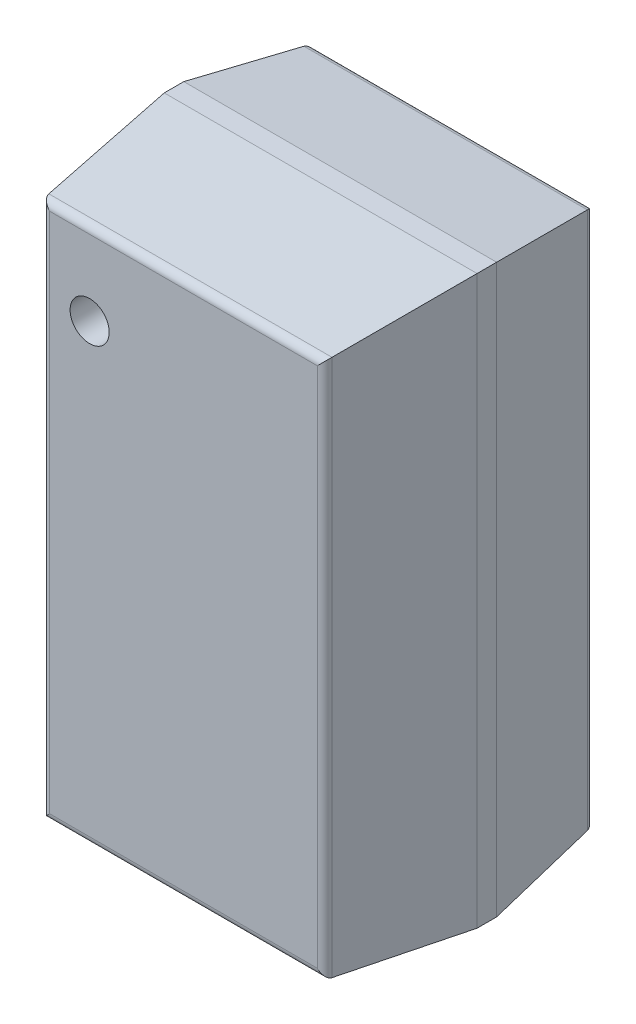
ISO-10303-21;
HEADER;
FILE_DESCRIPTION(('STEP AP214'),'2;1');
FILE_NAME('part.step','',(''),(''),'','','');
FILE_SCHEMA(('AUTOMOTIVE_DESIGN { 1 0 10303 214 1 1 1 1 }'));
ENDSEC;
DATA;
#1=APPLICATION_CONTEXT('core data for automotive mechanical design processes');
#2=APPLICATION_PROTOCOL_DEFINITION('international standard','automotive_design',2000,#1);
#3=PRODUCT_CONTEXT('',#1,'mechanical');
#4=PRODUCT('Part','Part','',(#3));
#5=PRODUCT_RELATED_PRODUCT_CATEGORY('part','',(#4));
#6=PRODUCT_DEFINITION_FORMATION('','',#4);
#7=PRODUCT_DEFINITION_CONTEXT('part definition',#1,'design');
#8=PRODUCT_DEFINITION('design','',#6,#7);
#9=PRODUCT_DEFINITION_SHAPE('','',#8);
#10=(LENGTH_UNIT() NAMED_UNIT(*) SI_UNIT(.MILLI.,.METRE.));
#11=(NAMED_UNIT(*) PLANE_ANGLE_UNIT() SI_UNIT($,.RADIAN.));
#12=(NAMED_UNIT(*) SI_UNIT($,.STERADIAN.) SOLID_ANGLE_UNIT());
#13=UNCERTAINTY_MEASURE_WITH_UNIT(LENGTH_MEASURE(1.E-05),#10,'distance_accuracy_value','');
#14=(GEOMETRIC_REPRESENTATION_CONTEXT(3) GLOBAL_UNCERTAINTY_ASSIGNED_CONTEXT((#13)) GLOBAL_UNIT_ASSIGNED_CONTEXT((#10,
#11,#12)) REPRESENTATION_CONTEXT('',''));
#15=CARTESIAN_POINT('',(0.,0.,0.));
#16=DIRECTION('',(0.,0.,1.));
#17=DIRECTION('',(1.,0.,0.));
#18=AXIS2_PLACEMENT_3D('',#15,#16,#17);
#19=CARTESIAN_POINT('',(-0.48,0.95,1.305));
#20=DIRECTION('',(0.,0.,1.));
#21=DIRECTION('',(1.,0.,0.));
#22=AXIS2_PLACEMENT_3D('',#19,#20,#21);
#23=PLANE('',#22);
#24=CARTESIAN_POINT('',(-0.48,0.95,1.305));
#25=DIRECTION('',(0.,0.,1.));
#26=DIRECTION('',(1.,0.,0.));
#27=AXIS2_PLACEMENT_3D('',#24,#25,#26);
#28=CIRCLE('',#27,0.1);
#29=CARTESIAN_POINT('',(-0.38,0.95,1.305));
#30=VERTEX_POINT('',#29);
#31=EDGE_CURVE('E25',#30,#30,#28,.T.);
#32=ORIENTED_EDGE('',*,*,#31,.T.);
#33=EDGE_LOOP('',(#32));
#34=FACE_BOUND('',#33,.T.);
#35=ADVANCED_FACE('F17',(#34),#23,.T.);
#36=CARTESIAN_POINT('',(-0.48,0.95,1.305));
#37=DIRECTION('',(0.,0.,1.));
#38=DIRECTION('',(1.,0.,0.));
#39=AXIS2_PLACEMENT_3D('',#36,#37,#38);
#40=CYLINDRICAL_SURFACE('',#39,0.1);
#41=ORIENTED_EDGE('',*,*,#31,.F.);
#42=DIRECTION('',(0.,0.,1.));
#43=VECTOR('',#42,1.);
#44=CARTESIAN_POINT('',(-0.38,0.95,1.305));
#45=LINE('',#44,#43);
#46=CARTESIAN_POINT('',(-0.38,0.95,1.45));
#47=VERTEX_POINT('',#46);
#48=EDGE_CURVE('E11',#30,#47,#45,.T.);
#49=ORIENTED_EDGE('',*,*,#48,.T.);
#50=CARTESIAN_POINT('',(-0.48,0.95,1.45));
#51=DIRECTION('',(0.,0.,1.));
#52=DIRECTION('',(1.,0.,0.));
#53=AXIS2_PLACEMENT_3D('',#50,#51,#52);
#54=CIRCLE('',#53,0.1);
#55=EDGE_CURVE('E193',#47,#47,#54,.T.);
#56=ORIENTED_EDGE('',*,*,#55,.T.);
#57=ORIENTED_EDGE('',*,*,#48,.F.);
#58=EDGE_LOOP('',(#41,#49,#56,#57));
#59=FACE_BOUND('',#58,.T.);
#60=ADVANCED_FACE('F260',(#59),#40,.F.);
#61=CARTESIAN_POINT('',(0.68430217805,-1.37,1.41));
#62=DIRECTION('',(0.,1.,0.));
#63=DIRECTION('',(0.,0.,1.));
#64=AXIS2_PLACEMENT_3D('',#61,#62,#63);
#65=CYLINDRICAL_SURFACE('',#64,0.04);
#66=CARTESIAN_POINT('',(0.68430217805,-1.33430217805,1.41));
#67=DIRECTION('',(-0.707106781186548,-0.707106781186548,0.));
#68=DIRECTION('',(0.707106781186548,-0.707106781186548,0.));
#69=AXIS2_PLACEMENT_3D('',#66,#67,#68);
#70=ELLIPSE('',#69,0.05656854249492,0.04);
#71=CARTESIAN_POINT('',(0.724044605579,-1.374044605579,1.414532047456));
#72=VERTEX_POINT('',#71);
#73=CARTESIAN_POINT('',(0.68430217805,-1.33430217805,1.45));
#74=VERTEX_POINT('',#73);
#75=EDGE_CURVE('E243',#72,#74,#70,.T.);
#76=ORIENTED_EDGE('',*,*,#75,.F.);
#77=DIRECTION('',(0.,1.,0.));
#78=VECTOR('',#77,1.);
#79=CARTESIAN_POINT('',(0.724044605579,-1.37,1.414532047456));
#80=LINE('',#79,#78);
#81=CARTESIAN_POINT('',(0.724044605579,1.374044605579,1.414532047456));
#82=VERTEX_POINT('',#81);
#83=EDGE_CURVE('E147',#72,#82,#80,.T.);
#84=ORIENTED_EDGE('',*,*,#83,.T.);
#85=CARTESIAN_POINT('',(0.68430217805,1.33430217805,1.41));
#86=DIRECTION('',(-0.707106781186548,0.707106781186548,0.));
#87=DIRECTION('',(0.707106781186548,0.707106781186548,0.));
#88=AXIS2_PLACEMENT_3D('',#85,#86,#87);
#89=ELLIPSE('',#88,0.05656854249492,0.04);
#90=CARTESIAN_POINT('',(0.68430217805,1.33430217805,1.45));
#91=VERTEX_POINT('',#90);
#92=EDGE_CURVE('E195',#91,#82,#89,.T.);
#93=ORIENTED_EDGE('',*,*,#92,.F.);
#94=DIRECTION('',(0.,1.,0.));
#95=VECTOR('',#94,1.);
#96=CARTESIAN_POINT('',(0.68430217805,-1.37,1.45));
#97=LINE('',#96,#95);
#98=EDGE_CURVE('E251',#74,#91,#97,.T.);
#99=ORIENTED_EDGE('',*,*,#98,.F.);
#100=EDGE_LOOP('',(#76,#84,#93,#99));
#101=FACE_BOUND('',#100,.T.);
#102=ADVANCED_FACE('F262',(#101),#65,.T.);
#103=CARTESIAN_POINT('',(-0.72,1.33430217805,1.41));
#104=DIRECTION('',(1.,0.,0.));
#105=DIRECTION('',(0.,0.,1.));
#106=AXIS2_PLACEMENT_3D('',#103,#104,#105);
#107=CYLINDRICAL_SURFACE('',#106,0.04);
#108=DIRECTION('',(1.,0.,0.));
#109=VECTOR('',#108,1.);
#110=CARTESIAN_POINT('',(-0.72,1.33430217805,1.45));
#111=LINE('',#110,#109);
#112=CARTESIAN_POINT('',(-0.68430217805,1.33430217805,1.45));
#113=VERTEX_POINT('',#112);
#114=EDGE_CURVE('E196',#113,#91,#111,.T.);
#115=ORIENTED_EDGE('',*,*,#114,.T.);
#116=ORIENTED_EDGE('',*,*,#92,.T.);
#117=DIRECTION('',(1.,0.,0.));
#118=VECTOR('',#117,1.);
#119=CARTESIAN_POINT('',(-0.72,1.374044605579,1.414532047456));
#120=LINE('',#119,#118);
#121=CARTESIAN_POINT('',(-0.724044605579,1.374044605579,1.414532047456));
#122=VERTEX_POINT('',#121);
#123=EDGE_CURVE('E239',#122,#82,#120,.T.);
#124=ORIENTED_EDGE('',*,*,#123,.F.);
#125=CARTESIAN_POINT('',(-0.68430217805,1.33430217805,1.41));
#126=DIRECTION('',(0.707106781186548,0.707106781186548,0.));
#127=DIRECTION('',(-0.707106781186548,0.707106781186548,0.));
#128=AXIS2_PLACEMENT_3D('',#125,#126,#127);
#129=ELLIPSE('',#128,0.05656854249492,0.04);
#130=EDGE_CURVE('E235',#122,#113,#129,.T.);
#131=ORIENTED_EDGE('',*,*,#130,.T.);
#132=EDGE_LOOP('',(#115,#116,#124,#131));
#133=FACE_BOUND('',#132,.T.);
#134=ADVANCED_FACE('F268',(#133),#107,.T.);
#135=CARTESIAN_POINT('',(-0.8,-1.45,1.45));
#136=DIRECTION('',(0.,0.,1.));
#137=DIRECTION('',(1.,0.,0.));
#138=AXIS2_PLACEMENT_3D('',#135,#136,#137);
#139=PLANE('',#138);
#140=ORIENTED_EDGE('',*,*,#55,.F.);
#141=EDGE_LOOP('',(#140));
#142=FACE_BOUND('',#141,.T.);
#143=DIRECTION('',(0.,1.,0.));
#144=VECTOR('',#143,1.);
#145=CARTESIAN_POINT('',(-0.68430217805,-1.37,1.45));
#146=LINE('',#145,#144);
#147=CARTESIAN_POINT('',(-0.68430217805,-1.33430217805,1.45));
#148=VERTEX_POINT('',#147);
#149=EDGE_CURVE('E231',#148,#113,#146,.T.);
#150=ORIENTED_EDGE('',*,*,#149,.F.);
#151=DIRECTION('',(1.,0.,0.));
#152=VECTOR('',#151,1.);
#153=CARTESIAN_POINT('',(-0.72,-1.33430217805,1.45));
#154=LINE('',#153,#152);
#155=EDGE_CURVE('E247',#148,#74,#154,.T.);
#156=ORIENTED_EDGE('',*,*,#155,.T.);
#157=ORIENTED_EDGE('',*,*,#98,.T.);
#158=ORIENTED_EDGE('',*,*,#114,.F.);
#159=EDGE_LOOP('',(#150,#156,#157,#158));
#160=FACE_BOUND('',#159,.T.);
#161=ADVANCED_FACE('F274',(#142,#160),#139,.T.);
#162=CARTESIAN_POINT('',(-0.72,-1.33430217805,1.41));
#163=DIRECTION('',(1.,0.,0.));
#164=DIRECTION('',(0.,-0.993560688212825,0.11330118639298));
#165=AXIS2_PLACEMENT_3D('',#162,#163,#164);
#166=CYLINDRICAL_SURFACE('',#165,0.04);
#167=DIRECTION('',(1.,0.,0.));
#168=VECTOR('',#167,1.);
#169=CARTESIAN_POINT('',(-0.72,-1.374044605579,1.414532047456));
#170=LINE('',#169,#168);
#171=CARTESIAN_POINT('',(-0.724044605579,-1.374044605579,1.414532047456));
#172=VERTEX_POINT('',#171);
#173=EDGE_CURVE('E153',#172,#72,#170,.T.);
#174=ORIENTED_EDGE('',*,*,#173,.T.);
#175=ORIENTED_EDGE('',*,*,#75,.T.);
#176=ORIENTED_EDGE('',*,*,#155,.F.);
#177=CARTESIAN_POINT('',(-0.68430217805,-1.33430217805,1.41));
#178=DIRECTION('',(-0.707106781186548,0.707106781186548,0.));
#179=DIRECTION('',(0.707106781186548,0.707106781186548,0.));
#180=AXIS2_PLACEMENT_3D('',#177,#178,#179);
#181=ELLIPSE('',#180,0.05656854249492,0.04);
#182=EDGE_CURVE('E227',#172,#148,#181,.T.);
#183=ORIENTED_EDGE('',*,*,#182,.F.);
#184=EDGE_LOOP('',(#174,#175,#176,#183));
#185=FACE_BOUND('',#184,.T.);
#186=ADVANCED_FACE('F278',(#185),#166,.T.);
#187=CARTESIAN_POINT('',(0.76,-1.45,1.099232026655));
#188=DIRECTION('',(0.993560688212825,0.,0.11330118639298));
#189=DIRECTION('',(0.,-1.,0.));
#190=AXIS2_PLACEMENT_3D('',#187,#188,#189);
#191=PLANE('',#190);
#192=DIRECTION('',(-0.112580881361013,0.112580881361013,0.987244189805114));
#193=VECTOR('',#192,1.);
#194=CARTESIAN_POINT('',(0.750367414316,-1.400367414316,1.18370209062));
#195=LINE('',#194,#193);
#196=CARTESIAN_POINT('',(0.8,-1.45,0.74846405331));
#197=VERTEX_POINT('',#196);
#198=EDGE_CURVE('E140',#197,#72,#195,.T.);
#199=ORIENTED_EDGE('',*,*,#198,.F.);
#200=DIRECTION('',(0.,1.,0.));
#201=VECTOR('',#200,1.);
#202=CARTESIAN_POINT('',(0.8,-1.45,0.74846405331));
#203=LINE('',#202,#201);
#204=CARTESIAN_POINT('',(0.8,1.45,0.74846405331));
#205=VERTEX_POINT('',#204);
#206=EDGE_CURVE('E144',#197,#205,#203,.T.);
#207=ORIENTED_EDGE('',*,*,#206,.T.);
#208=DIRECTION('',(-0.112580881361013,-0.112580881361013,0.987244189805114));
#209=VECTOR('',#208,1.);
#210=CARTESIAN_POINT('',(0.731989454786,1.381989454786,1.344862081079));
#211=LINE('',#210,#209);
#212=EDGE_CURVE('E240',#205,#82,#211,.T.);
#213=ORIENTED_EDGE('',*,*,#212,.T.);
#214=ORIENTED_EDGE('',*,*,#83,.F.);
#215=EDGE_LOOP('',(#199,#207,#213,#214));
#216=FACE_BOUND('',#215,.T.);
#217=ADVANCED_FACE('F142',(#216),#191,.T.);
#218=CARTESIAN_POINT('',(-0.8,1.41,1.099232026655));
#219=DIRECTION('',(0.,0.993560688212825,0.11330118639298));
#220=DIRECTION('',(1.,0.,0.));
#221=AXIS2_PLACEMENT_3D('',#218,#219,#220);
#222=PLANE('',#221);
#223=ORIENTED_EDGE('',*,*,#123,.T.);
#224=ORIENTED_EDGE('',*,*,#212,.F.);
#225=DIRECTION('',(1.,0.,0.));
#226=VECTOR('',#225,1.);
#227=CARTESIAN_POINT('',(-0.8,1.45,0.74846405331));
#228=LINE('',#227,#226);
#229=CARTESIAN_POINT('',(-0.8,1.45,0.74846405331));
#230=VERTEX_POINT('',#229);
#231=EDGE_CURVE('E165',#230,#205,#228,.T.);
#232=ORIENTED_EDGE('',*,*,#231,.F.);
#233=DIRECTION('',(0.112580881361013,-0.112580881361013,0.987244189805114));
#234=VECTOR('',#233,1.);
#235=CARTESIAN_POINT('',(-0.742129018664,1.392129018664,1.255946224274));
#236=LINE('',#235,#234);
#237=EDGE_CURVE('E219',#230,#122,#236,.T.);
#238=ORIENTED_EDGE('',*,*,#237,.T.);
#239=EDGE_LOOP('',(#223,#224,#232,#238));
#240=FACE_BOUND('',#239,.T.);
#241=ADVANCED_FACE('F285',(#240),#222,.T.);
#242=CARTESIAN_POINT('',(-0.68430217805,-1.37,1.41));
#243=DIRECTION('',(0.,1.,0.));
#244=DIRECTION('',(-0.993560688212825,0.,0.11330118639298));
#245=AXIS2_PLACEMENT_3D('',#242,#243,#244);
#246=CYLINDRICAL_SURFACE('',#245,0.04);
#247=ORIENTED_EDGE('',*,*,#182,.T.);
#248=ORIENTED_EDGE('',*,*,#149,.T.);
#249=ORIENTED_EDGE('',*,*,#130,.F.);
#250=DIRECTION('',(0.,1.,0.));
#251=VECTOR('',#250,1.);
#252=CARTESIAN_POINT('',(-0.724044605579,-1.37,1.414532047456));
#253=LINE('',#252,#251);
#254=EDGE_CURVE('E215',#172,#122,#253,.T.);
#255=ORIENTED_EDGE('',*,*,#254,.F.);
#256=EDGE_LOOP('',(#247,#248,#249,#255));
#257=FACE_BOUND('',#256,.T.);
#258=ADVANCED_FACE('F288',(#257),#246,.T.);
#259=CARTESIAN_POINT('',(-0.8,-1.41,1.099232026655));
#260=DIRECTION('',(0.,0.993560688212825,-0.11330118639298));
#261=DIRECTION('',(-1.,0.,0.));
#262=AXIS2_PLACEMENT_3D('',#259,#260,#261);
#263=PLANE('',#262);
#264=DIRECTION('',(0.112580881361013,0.112580881361013,0.987244189805114));
#265=VECTOR('',#264,1.);
#266=CARTESIAN_POINT('',(-0.760506978194,-1.410506978194,1.094786233815));
#267=LINE('',#266,#265);
#268=CARTESIAN_POINT('',(-0.8,-1.45,0.74846405331));
#269=VERTEX_POINT('',#268);
#270=EDGE_CURVE('E180',#269,#172,#267,.T.);
#271=ORIENTED_EDGE('',*,*,#270,.F.);
#272=DIRECTION('',(1.,0.,0.));
#273=VECTOR('',#272,1.);
#274=CARTESIAN_POINT('',(-0.8,-1.45,0.74846405331));
#275=LINE('',#274,#273);
#276=EDGE_CURVE('E170',#269,#197,#275,.T.);
#277=ORIENTED_EDGE('',*,*,#276,.T.);
#278=ORIENTED_EDGE('',*,*,#198,.T.);
#279=ORIENTED_EDGE('',*,*,#173,.F.);
#280=EDGE_LOOP('',(#271,#277,#278,#279));
#281=FACE_BOUND('',#280,.T.);
#282=ADVANCED_FACE('F178',(#281),#263,.F.);
#283=CARTESIAN_POINT('',(0.8,-1.45,0.075));
#284=DIRECTION('',(1.,0.,0.));
#285=DIRECTION('',(0.,1.,0.));
#286=AXIS2_PLACEMENT_3D('',#283,#284,#285);
#287=PLANE('',#286);
#288=DIRECTION('',(0.,0.,1.));
#289=VECTOR('',#288,1.);
#290=CARTESIAN_POINT('',(0.8,-1.45,0.075));
#291=LINE('',#290,#289);
#292=CARTESIAN_POINT('',(0.8,-1.45,0.64846405331));
#293=VERTEX_POINT('',#292);
#294=EDGE_CURVE('E161',#293,#197,#291,.T.);
#295=ORIENTED_EDGE('',*,*,#294,.F.);
#296=DIRECTION('',(0.,1.,0.));
#297=VECTOR('',#296,1.);
#298=CARTESIAN_POINT('',(0.8,-1.45,0.64846405331));
#299=LINE('',#298,#297);
#300=CARTESIAN_POINT('',(0.8,1.45,0.64846405331));
#301=VERTEX_POINT('',#300);
#302=EDGE_CURVE('E203',#293,#301,#299,.T.);
#303=ORIENTED_EDGE('',*,*,#302,.T.);
#304=DIRECTION('',(0.,0.,1.));
#305=VECTOR('',#304,1.);
#306=CARTESIAN_POINT('',(0.8,1.45,0.075));
#307=LINE('',#306,#305);
#308=EDGE_CURVE('E163',#301,#205,#307,.T.);
#309=ORIENTED_EDGE('',*,*,#308,.T.);
#310=ORIENTED_EDGE('',*,*,#206,.F.);
#311=EDGE_LOOP('',(#295,#303,#309,#310));
#312=FACE_BOUND('',#311,.T.);
#313=ADVANCED_FACE('F159',(#312),#287,.T.);
#314=CARTESIAN_POINT('',(0.685192776379,-1.37,0.115));
#315=DIRECTION('',(0.,1.,0.));
#316=DIRECTION('',(0.,0.,-1.));
#317=AXIS2_PLACEMENT_3D('',#314,#315,#316);
#318=CYLINDRICAL_SURFACE('',#317,0.04);
#319=DIRECTION('',(0.,1.,0.));
#320=VECTOR('',#319,1.);
#321=CARTESIAN_POINT('',(0.685192776379,-1.37,0.075));
#322=LINE('',#321,#320);
#323=CARTESIAN_POINT('',(0.685192776379,-1.335192776379,0.075));
#324=VERTEX_POINT('',#323);
#325=CARTESIAN_POINT('',(0.685192776379,1.335192776379,0.075));
#326=VERTEX_POINT('',#325);
#327=EDGE_CURVE('E208',#324,#326,#322,.T.);
#328=ORIENTED_EDGE('',*,*,#327,.T.);
#329=CARTESIAN_POINT('',(0.685192776379,1.335192776379,0.115));
#330=DIRECTION('',(0.707106781186548,-0.707106781186548,0.));
#331=DIRECTION('',(0.707106781186548,0.707106781186548,0.));
#332=AXIS2_PLACEMENT_3D('',#329,#330,#331);
#333=ELLIPSE('',#332,0.05656854249492,0.04);
#334=CARTESIAN_POINT('',(0.72480914464,1.37480914464,0.109473394727));
#335=VERTEX_POINT('',#334);
#336=EDGE_CURVE('E212',#326,#335,#333,.T.);
#337=ORIENTED_EDGE('',*,*,#336,.T.);
#338=DIRECTION('',(0.,1.,0.));
#339=VECTOR('',#338,1.);
#340=CARTESIAN_POINT('',(0.72480914464,-1.37,0.109473394727));
#341=LINE('',#340,#339);
#342=CARTESIAN_POINT('',(0.72480914464,-1.37480914464,0.109473394727));
#343=VERTEX_POINT('',#342);
#344=EDGE_CURVE('E176',#343,#335,#341,.T.);
#345=ORIENTED_EDGE('',*,*,#344,.F.);
#346=CARTESIAN_POINT('',(0.685192776379,-1.335192776379,0.115));
#347=DIRECTION('',(0.707106781186548,0.707106781186548,0.));
#348=DIRECTION('',(0.707106781186548,-0.707106781186548,0.));
#349=AXIS2_PLACEMENT_3D('',#346,#347,#348);
#350=ELLIPSE('',#349,0.05656854249492,0.04);
#351=EDGE_CURVE('E182',#343,#324,#350,.T.);
#352=ORIENTED_EDGE('',*,*,#351,.T.);
#353=EDGE_LOOP('',(#328,#337,#345,#352));
#354=FACE_BOUND('',#353,.T.);
#355=ADVANCED_FACE('F294',(#354),#318,.T.);
#356=CARTESIAN_POINT('',(-0.8,1.45,0.075));
#357=DIRECTION('',(0.,1.,0.));
#358=DIRECTION('',(1.,0.,0.));
#359=AXIS2_PLACEMENT_3D('',#356,#357,#358);
#360=PLANE('',#359);
#361=ORIENTED_EDGE('',*,*,#308,.F.);
#362=DIRECTION('',(1.,0.,0.));
#363=VECTOR('',#362,1.);
#364=CARTESIAN_POINT('',(-0.8,1.45,0.64846405331));
#365=LINE('',#364,#363);
#366=CARTESIAN_POINT('',(-0.8,1.45,0.64846405331));
#367=VERTEX_POINT('',#366);
#368=EDGE_CURVE('E406',#367,#301,#365,.T.);
#369=ORIENTED_EDGE('',*,*,#368,.F.);
#370=DIRECTION('',(0.,0.,1.));
#371=VECTOR('',#370,1.);
#372=CARTESIAN_POINT('',(-0.8,1.45,0.075));
#373=LINE('',#372,#371);
#374=EDGE_CURVE('E407',#367,#230,#373,.T.);
#375=ORIENTED_EDGE('',*,*,#374,.T.);
#376=ORIENTED_EDGE('',*,*,#231,.T.);
#377=EDGE_LOOP('',(#361,#369,#375,#376));
#378=FACE_BOUND('',#377,.T.);
#379=ADVANCED_FACE('F299',(#378),#360,.T.);
#380=CARTESIAN_POINT('',(-0.76,-1.45,1.099232026655));
#381=DIRECTION('',(0.993560688212825,0.,-0.11330118639298));
#382=DIRECTION('',(0.,-1.,0.));
#383=AXIS2_PLACEMENT_3D('',#380,#381,#382);
#384=PLANE('',#383);
#385=ORIENTED_EDGE('',*,*,#254,.T.);
#386=ORIENTED_EDGE('',*,*,#237,.F.);
#387=DIRECTION('',(0.,1.,0.));
#388=VECTOR('',#387,1.);
#389=CARTESIAN_POINT('',(-0.8,-1.45,0.74846405331));
#390=LINE('',#389,#388);
#391=EDGE_CURVE('E402',#269,#230,#390,.T.);
#392=ORIENTED_EDGE('',*,*,#391,.F.);
#393=ORIENTED_EDGE('',*,*,#270,.T.);
#394=EDGE_LOOP('',(#385,#386,#392,#393));
#395=FACE_BOUND('',#394,.T.);
#396=ADVANCED_FACE('F295',(#395),#384,.F.);
#397=CARTESIAN_POINT('',(-0.72,1.335192776379,0.115));
#398=DIRECTION('',(1.,0.,0.));
#399=DIRECTION('',(0.,0.,-1.));
#400=AXIS2_PLACEMENT_3D('',#397,#398,#399);
#401=CYLINDRICAL_SURFACE('',#400,0.04);
#402=CARTESIAN_POINT('',(-0.685192776379,1.335192776379,0.115));
#403=DIRECTION('',(-0.707106781186548,-0.707106781186548,0.));
#404=DIRECTION('',(-0.707106781186548,0.707106781186548,0.));
#405=AXIS2_PLACEMENT_3D('',#402,#403,#404);
#406=ELLIPSE('',#405,0.05656854249492,0.04);
#407=CARTESIAN_POINT('',(-0.72480914464,1.37480914464,0.109473394727));
#408=VERTEX_POINT('',#407);
#409=CARTESIAN_POINT('',(-0.685192776379,1.335192776379,0.075));
#410=VERTEX_POINT('',#409);
#411=EDGE_CURVE('E373',#408,#410,#406,.T.);
#412=ORIENTED_EDGE('',*,*,#411,.F.);
#413=DIRECTION('',(1.,0.,0.));
#414=VECTOR('',#413,1.);
#415=CARTESIAN_POINT('',(-0.72,1.37480914464,0.109473394727));
#416=LINE('',#415,#414);
#417=EDGE_CURVE('E394',#408,#335,#416,.T.);
#418=ORIENTED_EDGE('',*,*,#417,.T.);
#419=ORIENTED_EDGE('',*,*,#336,.F.);
#420=DIRECTION('',(1.,0.,0.));
#421=VECTOR('',#420,1.);
#422=CARTESIAN_POINT('',(-0.72,1.335192776379,0.075));
#423=LINE('',#422,#421);
#424=EDGE_CURVE('E204',#410,#326,#423,.T.);
#425=ORIENTED_EDGE('',*,*,#424,.F.);
#426=EDGE_LOOP('',(#412,#418,#419,#425));
#427=FACE_BOUND('',#426,.T.);
#428=ADVANCED_FACE('F298',(#427),#401,.T.);
#429=CARTESIAN_POINT('',(-0.8,-1.45,0.075));
#430=DIRECTION('',(0.,0.,1.));
#431=DIRECTION('',(1.,0.,0.));
#432=AXIS2_PLACEMENT_3D('',#429,#430,#431);
#433=PLANE('',#432);
#434=ORIENTED_EDGE('',*,*,#424,.T.);
#435=ORIENTED_EDGE('',*,*,#327,.F.);
#436=DIRECTION('',(1.,0.,0.));
#437=VECTOR('',#436,1.);
#438=CARTESIAN_POINT('',(-0.72,-1.335192776379,0.075));
#439=LINE('',#438,#437);
#440=CARTESIAN_POINT('',(-0.685192776379,-1.335192776379,0.075));
#441=VERTEX_POINT('',#440);
#442=EDGE_CURVE('E189',#441,#324,#439,.T.);
#443=ORIENTED_EDGE('',*,*,#442,.F.);
#444=DIRECTION('',(0.,1.,0.));
#445=VECTOR('',#444,1.);
#446=CARTESIAN_POINT('',(-0.685192776379,-1.37,0.075));
#447=LINE('',#446,#445);
#448=EDGE_CURVE('E377',#441,#410,#447,.T.);
#449=ORIENTED_EDGE('',*,*,#448,.T.);
#450=EDGE_LOOP('',(#434,#435,#443,#449));
#451=FACE_BOUND('',#450,.T.);
#452=ADVANCED_FACE('F301',(#451),#433,.F.);
#453=CARTESIAN_POINT('',(0.76,-1.45,0.361732026655));
#454=DIRECTION('',(-0.990409206514318,0.,0.138165131823044));
#455=DIRECTION('',(0.,1.,0.));
#456=AXIS2_PLACEMENT_3D('',#453,#454,#455);
#457=PLANE('',#456);
#458=ORIENTED_EDGE('',*,*,#344,.T.);
#459=DIRECTION('',(-0.136864958531939,-0.136864958531939,-0.981089173445565));
#460=VECTOR('',#459,1.);
#461=CARTESIAN_POINT('',(0.718602242709,1.368602242709,0.06498045547816));
#462=LINE('',#461,#460);
#463=EDGE_CURVE('E398',#301,#335,#462,.T.);
#464=ORIENTED_EDGE('',*,*,#463,.F.);
#465=ORIENTED_EDGE('',*,*,#302,.F.);
#466=DIRECTION('',(-0.136864958531939,0.136864958531939,-0.981089173445565));
#467=VECTOR('',#466,1.);
#468=CARTESIAN_POINT('',(0.745763667176,-1.395763667176,0.259681712585));
#469=LINE('',#468,#467);
#470=EDGE_CURVE('E369',#293,#343,#469,.T.);
#471=ORIENTED_EDGE('',*,*,#470,.T.);
#472=EDGE_LOOP('',(#458,#464,#465,#471));
#473=FACE_BOUND('',#472,.T.);
#474=ADVANCED_FACE('F304',(#473),#457,.F.);
#475=CARTESIAN_POINT('',(-0.8,-1.45,0.075));
#476=DIRECTION('',(0.,1.,0.));
#477=DIRECTION('',(1.,0.,0.));
#478=AXIS2_PLACEMENT_3D('',#475,#476,#477);
#479=PLANE('',#478);
#480=ORIENTED_EDGE('',*,*,#276,.F.);
#481=DIRECTION('',(0.,0.,1.));
#482=VECTOR('',#481,1.);
#483=CARTESIAN_POINT('',(-0.8,-1.45,0.075));
#484=LINE('',#483,#482);
#485=CARTESIAN_POINT('',(-0.8,-1.45,0.64846405331));
#486=VERTEX_POINT('',#485);
#487=EDGE_CURVE('E403',#486,#269,#484,.T.);
#488=ORIENTED_EDGE('',*,*,#487,.F.);
#489=DIRECTION('',(1.,0.,0.));
#490=VECTOR('',#489,1.);
#491=CARTESIAN_POINT('',(-0.8,-1.45,0.64846405331));
#492=LINE('',#491,#490);
#493=EDGE_CURVE('E173',#486,#293,#492,.T.);
#494=ORIENTED_EDGE('',*,*,#493,.T.);
#495=ORIENTED_EDGE('',*,*,#294,.T.);
#496=EDGE_LOOP('',(#480,#488,#494,#495));
#497=FACE_BOUND('',#496,.T.);
#498=ADVANCED_FACE('F169',(#497),#479,.F.);
#499=CARTESIAN_POINT('',(-0.72,-1.335192776379,0.115));
#500=DIRECTION('',(1.,0.,0.));
#501=DIRECTION('',(0.,-0.990409206514318,-0.138165131823044));
#502=AXIS2_PLACEMENT_3D('',#499,#500,#501);
#503=CYLINDRICAL_SURFACE('',#502,0.04);
#504=CARTESIAN_POINT('',(-0.685192776379,-1.335192776379,0.115));
#505=DIRECTION('',(0.707106781186548,-0.707106781186548,0.));
#506=DIRECTION('',(0.707106781186548,0.707106781186548,0.));
#507=AXIS2_PLACEMENT_3D('',#504,#505,#506);
#508=ELLIPSE('',#507,0.05656854249492,0.04);
#509=CARTESIAN_POINT('',(-0.72480914464,-1.37480914464,0.109473394727));
#510=VERTEX_POINT('',#509);
#511=EDGE_CURVE('E391',#510,#441,#508,.T.);
#512=ORIENTED_EDGE('',*,*,#511,.T.);
#513=ORIENTED_EDGE('',*,*,#442,.T.);
#514=ORIENTED_EDGE('',*,*,#351,.F.);
#515=DIRECTION('',(1.,0.,0.));
#516=VECTOR('',#515,1.);
#517=CARTESIAN_POINT('',(-0.72,-1.37480914464,0.109473394727));
#518=LINE('',#517,#516);
#519=EDGE_CURVE('E367',#510,#343,#518,.T.);
#520=ORIENTED_EDGE('',*,*,#519,.F.);
#521=EDGE_LOOP('',(#512,#513,#514,#520));
#522=FACE_BOUND('',#521,.T.);
#523=ADVANCED_FACE('F311',(#522),#503,.T.);
#524=CARTESIAN_POINT('',(-0.8,1.41,0.361732026655));
#525=DIRECTION('',(0.,-0.990409206514318,0.138165131823044));
#526=DIRECTION('',(-1.,0.,0.));
#527=AXIS2_PLACEMENT_3D('',#524,#525,#526);
#528=PLANE('',#527);
#529=DIRECTION('',(0.136864958531939,-0.136864958531939,-0.981089173445565));
#530=VECTOR('',#529,1.);
#531=CARTESIAN_POINT('',(-0.733587856208,1.383587856208,0.17240183871));
#532=LINE('',#531,#530);
#533=EDGE_CURVE('E364',#367,#408,#532,.T.);
#534=ORIENTED_EDGE('',*,*,#533,.F.);
#535=ORIENTED_EDGE('',*,*,#368,.T.);
#536=ORIENTED_EDGE('',*,*,#463,.T.);
#537=ORIENTED_EDGE('',*,*,#417,.F.);
#538=EDGE_LOOP('',(#534,#535,#536,#537));
#539=FACE_BOUND('',#538,.T.);
#540=ADVANCED_FACE('F320',(#539),#528,.F.);
#541=CARTESIAN_POINT('',(-0.8,-1.45,0.075));
#542=DIRECTION('',(1.,0.,0.));
#543=DIRECTION('',(0.,1.,0.));
#544=AXIS2_PLACEMENT_3D('',#541,#542,#543);
#545=PLANE('',#544);
#546=ORIENTED_EDGE('',*,*,#391,.T.);
#547=ORIENTED_EDGE('',*,*,#374,.F.);
#548=DIRECTION('',(0.,1.,0.));
#549=VECTOR('',#548,1.);
#550=CARTESIAN_POINT('',(-0.8,-1.45,0.64846405331));
#551=LINE('',#550,#549);
#552=EDGE_CURVE('E355',#486,#367,#551,.T.);
#553=ORIENTED_EDGE('',*,*,#552,.F.);
#554=ORIENTED_EDGE('',*,*,#487,.T.);
#555=EDGE_LOOP('',(#546,#547,#553,#554));
#556=FACE_BOUND('',#555,.T.);
#557=ADVANCED_FACE('F325',(#556),#545,.F.);
#558=CARTESIAN_POINT('',(-0.685192776379,-1.37,0.115));
#559=DIRECTION('',(0.,1.,0.));
#560=DIRECTION('',(-0.990409206514318,0.,-0.138165131823044));
#561=AXIS2_PLACEMENT_3D('',#558,#559,#560);
#562=CYLINDRICAL_SURFACE('',#561,0.04);
#563=DIRECTION('',(0.,1.,0.));
#564=VECTOR('',#563,1.);
#565=CARTESIAN_POINT('',(-0.72480914464,-1.37,0.109473394727));
#566=LINE('',#565,#564);
#567=EDGE_CURVE('E357',#510,#408,#566,.T.);
#568=ORIENTED_EDGE('',*,*,#567,.T.);
#569=ORIENTED_EDGE('',*,*,#411,.T.);
#570=ORIENTED_EDGE('',*,*,#448,.F.);
#571=ORIENTED_EDGE('',*,*,#511,.F.);
#572=EDGE_LOOP('',(#568,#569,#570,#571));
#573=FACE_BOUND('',#572,.T.);
#574=ADVANCED_FACE('F328',(#573),#562,.T.);
#575=CARTESIAN_POINT('',(-0.8,-1.41,0.361732026655));
#576=DIRECTION('',(0.,-0.990409206514318,-0.138165131823044));
#577=DIRECTION('',(0.,0.138165131823044,-0.990409206514318));
#578=AXIS2_PLACEMENT_3D('',#575,#576,#577);
#579=PLANE('',#578);
#580=ORIENTED_EDGE('',*,*,#519,.T.);
#581=ORIENTED_EDGE('',*,*,#470,.F.);
#582=ORIENTED_EDGE('',*,*,#493,.F.);
#583=DIRECTION('',(0.136864958531939,0.136864958531939,-0.981089173445565));
#584=VECTOR('',#583,1.);
#585=CARTESIAN_POINT('',(-0.760749280675,-1.410749280675,0.367103095817));
#586=LINE('',#585,#584);
#587=EDGE_CURVE('E352',#486,#510,#586,.T.);
#588=ORIENTED_EDGE('',*,*,#587,.T.);
#589=EDGE_LOOP('',(#580,#581,#582,#588));
#590=FACE_BOUND('',#589,.T.);
#591=ADVANCED_FACE('F332',(#590),#579,.T.);
#592=CARTESIAN_POINT('',(-0.76,-1.45,0.361732026655));
#593=DIRECTION('',(-0.990409206514318,0.,-0.138165131823044));
#594=DIRECTION('',(-0.138165131823044,0.,0.990409206514318));
#595=AXIS2_PLACEMENT_3D('',#592,#593,#594);
#596=PLANE('',#595);
#597=ORIENTED_EDGE('',*,*,#587,.F.);
#598=ORIENTED_EDGE('',*,*,#552,.T.);
#599=ORIENTED_EDGE('',*,*,#533,.T.);
#600=ORIENTED_EDGE('',*,*,#567,.F.);
#601=EDGE_LOOP('',(#597,#598,#599,#600));
#602=FACE_BOUND('',#601,.T.);
#603=ADVANCED_FACE('F339',(#602),#596,.T.);
#604=CLOSED_SHELL('',(#35,#60,#102,#134,#161,#186,#217,#241,#258,#282,#313,#355,#379,#396,#428,
#452,#474,#498,#523,#540,#557,#574,#591,#603));
#605=MANIFOLD_SOLID_BREP('B1',#604);
#606=ADVANCED_BREP_SHAPE_REPRESENTATION('',(#18,#605),#14);
#607=SHAPE_DEFINITION_REPRESENTATION(#9,#606);
ENDSEC;
END-ISO-10303-21;
